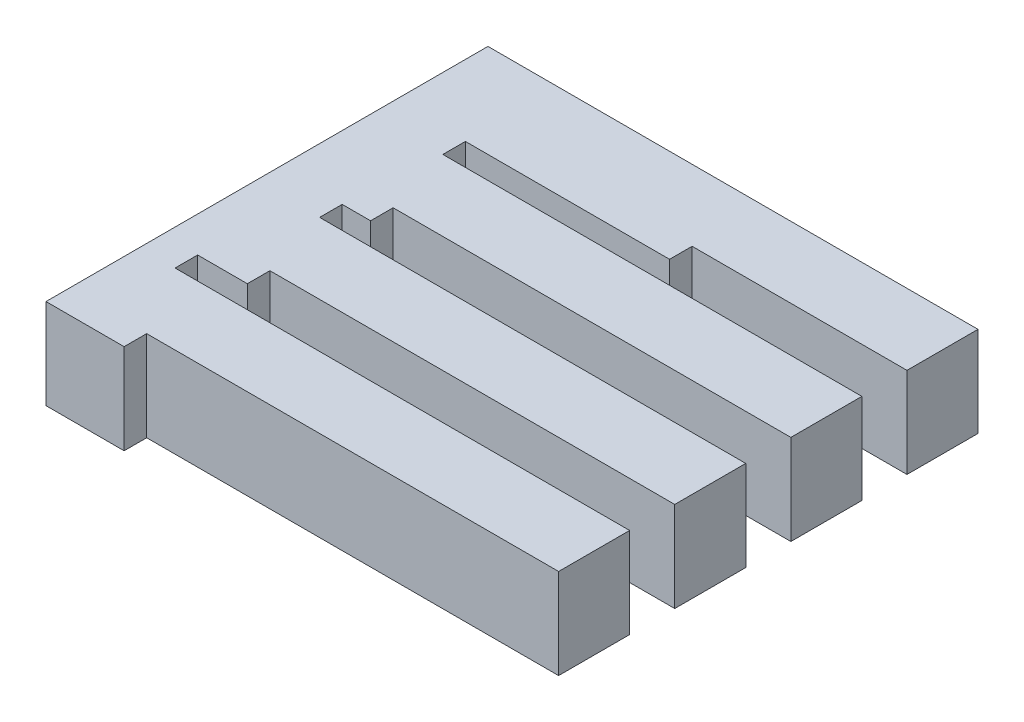
ISO-10303-21;
HEADER;
FILE_DESCRIPTION(('STEP AP214'),'2;1');
FILE_NAME('part.step','',(''),(''),'','','');
FILE_SCHEMA(('AUTOMOTIVE_DESIGN { 1 0 10303 214 1 1 1 1 }'));
ENDSEC;
DATA;
#1=APPLICATION_CONTEXT('core data for automotive mechanical design processes');
#2=APPLICATION_PROTOCOL_DEFINITION('international standard','automotive_design',2000,#1);
#3=PRODUCT_CONTEXT('',#1,'mechanical');
#4=PRODUCT('Part','Part','',(#3));
#5=PRODUCT_RELATED_PRODUCT_CATEGORY('part','',(#4));
#6=PRODUCT_DEFINITION_FORMATION('','',#4);
#7=PRODUCT_DEFINITION_CONTEXT('part definition',#1,'design');
#8=PRODUCT_DEFINITION('design','',#6,#7);
#9=PRODUCT_DEFINITION_SHAPE('','',#8);
#10=(LENGTH_UNIT() NAMED_UNIT(*) SI_UNIT(.MILLI.,.METRE.));
#11=(NAMED_UNIT(*) PLANE_ANGLE_UNIT() SI_UNIT($,.RADIAN.));
#12=(NAMED_UNIT(*) SI_UNIT($,.STERADIAN.) SOLID_ANGLE_UNIT());
#13=UNCERTAINTY_MEASURE_WITH_UNIT(LENGTH_MEASURE(1.E-05),#10,'distance_accuracy_value','');
#14=(GEOMETRIC_REPRESENTATION_CONTEXT(3) GLOBAL_UNCERTAINTY_ASSIGNED_CONTEXT((#13)) GLOBAL_UNIT_ASSIGNED_CONTEXT((#10,
#11,#12)) REPRESENTATION_CONTEXT('',''));
#15=CARTESIAN_POINT('',(0.,0.,0.));
#16=DIRECTION('',(0.,0.,1.));
#17=DIRECTION('',(1.,0.,0.));
#18=AXIS2_PLACEMENT_3D('',#15,#16,#17);
#19=CARTESIAN_POINT('',(-34.5,6.35,-31.1125));
#20=DIRECTION('',(1.,0.,0.));
#21=DIRECTION('',(0.,0.,-1.));
#22=AXIS2_PLACEMENT_3D('',#19,#20,#21);
#23=PLANE('',#22);
#24=DIRECTION('',(0.,0.,1.));
#25=VECTOR('',#24,1.);
#26=CARTESIAN_POINT('',(-34.5,-6.35,-31.1125));
#27=LINE('',#26,#25);
#28=CARTESIAN_POINT('',(-34.5,-6.35,-31.1125));
#29=VERTEX_POINT('',#28);
#30=CARTESIAN_POINT('',(-34.5,-6.35,31.1125));
#31=VERTEX_POINT('',#30);
#32=EDGE_CURVE('E224',#29,#31,#27,.T.);
#33=ORIENTED_EDGE('',*,*,#32,.T.);
#34=DIRECTION('',(0.,-1.,0.));
#35=VECTOR('',#34,1.);
#36=CARTESIAN_POINT('',(-34.5,6.35,31.1125));
#37=LINE('',#36,#35);
#38=CARTESIAN_POINT('',(-34.5,6.35,31.1125));
#39=VERTEX_POINT('',#38);
#40=EDGE_CURVE('E11',#39,#31,#37,.T.);
#41=ORIENTED_EDGE('',*,*,#40,.F.);
#42=DIRECTION('',(0.,0.,1.));
#43=VECTOR('',#42,1.);
#44=CARTESIAN_POINT('',(-34.5,6.35,-31.1125));
#45=LINE('',#44,#43);
#46=CARTESIAN_POINT('',(-34.5,6.35,-31.1125));
#47=VERTEX_POINT('',#46);
#48=EDGE_CURVE('E270',#47,#39,#45,.T.);
#49=ORIENTED_EDGE('',*,*,#48,.F.);
#50=DIRECTION('',(0.,-1.,0.));
#51=VECTOR('',#50,1.);
#52=CARTESIAN_POINT('',(-34.5,6.35,-31.1125));
#53=LINE('',#52,#51);
#54=EDGE_CURVE('E220',#47,#29,#53,.T.);
#55=ORIENTED_EDGE('',*,*,#54,.T.);
#56=EDGE_LOOP('',(#33,#41,#49,#55));
#57=FACE_BOUND('',#56,.T.);
#58=ADVANCED_FACE('F32',(#57),#23,.F.);
#59=CARTESIAN_POINT('',(-34.5,6.35,31.1125));
#60=DIRECTION('',(0.,0.,-1.));
#61=DIRECTION('',(-1.,0.,0.));
#62=AXIS2_PLACEMENT_3D('',#59,#60,#61);
#63=PLANE('',#62);
#64=DIRECTION('',(1.,0.,0.));
#65=VECTOR('',#64,1.);
#66=CARTESIAN_POINT('',(-34.5,-6.35,31.1125));
#67=LINE('',#66,#65);
#68=CARTESIAN_POINT('',(-23.5,-6.35,31.1125));
#69=VERTEX_POINT('',#68);
#70=EDGE_CURVE('E227',#31,#69,#67,.T.);
#71=ORIENTED_EDGE('',*,*,#70,.T.);
#72=DIRECTION('',(0.,-1.,0.));
#73=VECTOR('',#72,1.);
#74=CARTESIAN_POINT('',(-23.5,6.35,31.1125));
#75=LINE('',#74,#73);
#76=CARTESIAN_POINT('',(-23.5,6.35,31.1125));
#77=VERTEX_POINT('',#76);
#78=EDGE_CURVE('E40',#77,#69,#75,.T.);
#79=ORIENTED_EDGE('',*,*,#78,.F.);
#80=DIRECTION('',(1.,0.,0.));
#81=VECTOR('',#80,1.);
#82=CARTESIAN_POINT('',(-34.5,6.35,31.1125));
#83=LINE('',#82,#81);
#84=EDGE_CURVE('E139',#39,#77,#83,.T.);
#85=ORIENTED_EDGE('',*,*,#84,.F.);
#86=ORIENTED_EDGE('',*,*,#40,.T.);
#87=EDGE_LOOP('',(#71,#79,#85,#86));
#88=FACE_BOUND('',#87,.T.);
#89=ADVANCED_FACE('F408',(#88),#63,.F.);
#90=CARTESIAN_POINT('',(-23.5,6.35,31.1125));
#91=DIRECTION('',(-1.,0.,0.));
#92=DIRECTION('',(0.,0.,1.));
#93=AXIS2_PLACEMENT_3D('',#90,#91,#92);
#94=PLANE('',#93);
#95=DIRECTION('',(0.,0.,-1.));
#96=VECTOR('',#95,1.);
#97=CARTESIAN_POINT('',(-23.5,-6.35,31.1125));
#98=LINE('',#97,#96);
#99=CARTESIAN_POINT('',(-23.5,-6.35,27.9375));
#100=VERTEX_POINT('',#99);
#101=EDGE_CURVE('E229',#69,#100,#98,.T.);
#102=ORIENTED_EDGE('',*,*,#101,.T.);
#103=DIRECTION('',(0.,-1.,0.));
#104=VECTOR('',#103,1.);
#105=CARTESIAN_POINT('',(-23.5,6.35,27.9375));
#106=LINE('',#105,#104);
#107=CARTESIAN_POINT('',(-23.5,6.35,27.9375));
#108=VERTEX_POINT('',#107);
#109=EDGE_CURVE('E325',#108,#100,#106,.T.);
#110=ORIENTED_EDGE('',*,*,#109,.F.);
#111=DIRECTION('',(0.,0.,-1.));
#112=VECTOR('',#111,1.);
#113=CARTESIAN_POINT('',(-23.5,6.35,31.1125));
#114=LINE('',#113,#112);
#115=EDGE_CURVE('E333',#77,#108,#114,.T.);
#116=ORIENTED_EDGE('',*,*,#115,.F.);
#117=ORIENTED_EDGE('',*,*,#78,.T.);
#118=EDGE_LOOP('',(#102,#110,#116,#117));
#119=FACE_BOUND('',#118,.T.);
#120=ADVANCED_FACE('F331',(#119),#94,.F.);
#121=CARTESIAN_POINT('',(-23.5,6.35,27.9375));
#122=DIRECTION('',(0.,0.,-1.));
#123=DIRECTION('',(-1.,0.,0.));
#124=AXIS2_PLACEMENT_3D('',#121,#122,#123);
#125=PLANE('',#124);
#126=DIRECTION('',(1.,0.,0.));
#127=VECTOR('',#126,1.);
#128=CARTESIAN_POINT('',(-23.5,-6.35,27.9375));
#129=LINE('',#128,#127);
#130=CARTESIAN_POINT('',(34.5,-6.35,27.9375));
#131=VERTEX_POINT('',#130);
#132=EDGE_CURVE('E231',#100,#131,#129,.T.);
#133=ORIENTED_EDGE('',*,*,#132,.T.);
#134=DIRECTION('',(0.,-1.,0.));
#135=VECTOR('',#134,1.);
#136=CARTESIAN_POINT('',(34.5,6.35,27.9375));
#137=LINE('',#136,#135);
#138=CARTESIAN_POINT('',(34.5,6.35,27.9375));
#139=VERTEX_POINT('',#138);
#140=EDGE_CURVE('E322',#139,#131,#137,.T.);
#141=ORIENTED_EDGE('',*,*,#140,.F.);
#142=DIRECTION('',(1.,0.,0.));
#143=VECTOR('',#142,1.);
#144=CARTESIAN_POINT('',(-23.5,6.35,27.9375));
#145=LINE('',#144,#143);
#146=EDGE_CURVE('E351',#108,#139,#145,.T.);
#147=ORIENTED_EDGE('',*,*,#146,.F.);
#148=ORIENTED_EDGE('',*,*,#109,.T.);
#149=EDGE_LOOP('',(#133,#141,#147,#148));
#150=FACE_BOUND('',#149,.T.);
#151=ADVANCED_FACE('F342',(#150),#125,.F.);
#152=CARTESIAN_POINT('',(34.5,6.35,27.9375));
#153=DIRECTION('',(-1.,0.,0.));
#154=DIRECTION('',(0.,0.,1.));
#155=AXIS2_PLACEMENT_3D('',#152,#153,#154);
#156=PLANE('',#155);
#157=DIRECTION('',(0.,0.,-1.));
#158=VECTOR('',#157,1.);
#159=CARTESIAN_POINT('',(34.5,-6.35,27.9375));
#160=LINE('',#159,#158);
#161=CARTESIAN_POINT('',(34.5,-6.35,17.9375));
#162=VERTEX_POINT('',#161);
#163=EDGE_CURVE('E233',#131,#162,#160,.T.);
#164=ORIENTED_EDGE('',*,*,#163,.T.);
#165=DIRECTION('',(0.,-1.,0.));
#166=VECTOR('',#165,1.);
#167=CARTESIAN_POINT('',(34.5,6.35,17.9375));
#168=LINE('',#167,#166);
#169=CARTESIAN_POINT('',(34.5,6.35,17.9375));
#170=VERTEX_POINT('',#169);
#171=EDGE_CURVE('E319',#170,#162,#168,.T.);
#172=ORIENTED_EDGE('',*,*,#171,.F.);
#173=DIRECTION('',(0.,0.,-1.));
#174=VECTOR('',#173,1.);
#175=CARTESIAN_POINT('',(34.5,6.35,27.9375));
#176=LINE('',#175,#174);
#177=EDGE_CURVE('E348',#139,#170,#176,.T.);
#178=ORIENTED_EDGE('',*,*,#177,.F.);
#179=ORIENTED_EDGE('',*,*,#140,.T.);
#180=EDGE_LOOP('',(#164,#172,#178,#179));
#181=FACE_BOUND('',#180,.T.);
#182=ADVANCED_FACE('F346',(#181),#156,.F.);
#183=CARTESIAN_POINT('',(34.5,6.35,17.9375));
#184=DIRECTION('',(0.,0.,1.));
#185=DIRECTION('',(1.,0.,0.));
#186=AXIS2_PLACEMENT_3D('',#183,#184,#185);
#187=PLANE('',#186);
#188=DIRECTION('',(-1.,0.,0.));
#189=VECTOR('',#188,1.);
#190=CARTESIAN_POINT('',(34.5,-6.35,17.9375));
#191=LINE('',#190,#189);
#192=CARTESIAN_POINT('',(-29.5,-6.35,17.9375));
#193=VERTEX_POINT('',#192);
#194=EDGE_CURVE('E235',#162,#193,#191,.T.);
#195=ORIENTED_EDGE('',*,*,#194,.T.);
#196=DIRECTION('',(0.,-1.,0.));
#197=VECTOR('',#196,1.);
#198=CARTESIAN_POINT('',(-29.5,6.35,17.9375));
#199=LINE('',#198,#197);
#200=CARTESIAN_POINT('',(-29.5,6.35,17.9375));
#201=VERTEX_POINT('',#200);
#202=EDGE_CURVE('E316',#201,#193,#199,.T.);
#203=ORIENTED_EDGE('',*,*,#202,.F.);
#204=DIRECTION('',(-1.,0.,0.));
#205=VECTOR('',#204,1.);
#206=CARTESIAN_POINT('',(34.5,6.35,17.9375));
#207=LINE('',#206,#205);
#208=EDGE_CURVE('E350',#170,#201,#207,.T.);
#209=ORIENTED_EDGE('',*,*,#208,.F.);
#210=ORIENTED_EDGE('',*,*,#171,.T.);
#211=EDGE_LOOP('',(#195,#203,#209,#210));
#212=FACE_BOUND('',#211,.T.);
#213=ADVANCED_FACE('F421',(#212),#187,.F.);
#214=CARTESIAN_POINT('',(-29.5,6.35,17.9375));
#215=DIRECTION('',(-1.,0.,0.));
#216=DIRECTION('',(0.,0.,1.));
#217=AXIS2_PLACEMENT_3D('',#214,#215,#216);
#218=PLANE('',#217);
#219=DIRECTION('',(0.,0.,-1.));
#220=VECTOR('',#219,1.);
#221=CARTESIAN_POINT('',(-29.5,-6.35,17.9375));
#222=LINE('',#221,#220);
#223=CARTESIAN_POINT('',(-29.5,-6.35,14.7625));
#224=VERTEX_POINT('',#223);
#225=EDGE_CURVE('E237',#193,#224,#222,.T.);
#226=ORIENTED_EDGE('',*,*,#225,.T.);
#227=DIRECTION('',(0.,-1.,0.));
#228=VECTOR('',#227,1.);
#229=CARTESIAN_POINT('',(-29.5,6.35,14.7625));
#230=LINE('',#229,#228);
#231=CARTESIAN_POINT('',(-29.5,6.35,14.7625));
#232=VERTEX_POINT('',#231);
#233=EDGE_CURVE('E313',#232,#224,#230,.T.);
#234=ORIENTED_EDGE('',*,*,#233,.F.);
#235=DIRECTION('',(0.,0.,-1.));
#236=VECTOR('',#235,1.);
#237=CARTESIAN_POINT('',(-29.5,6.35,17.9375));
#238=LINE('',#237,#236);
#239=EDGE_CURVE('E353',#201,#232,#238,.T.);
#240=ORIENTED_EDGE('',*,*,#239,.F.);
#241=ORIENTED_EDGE('',*,*,#202,.T.);
#242=EDGE_LOOP('',(#226,#234,#240,#241));
#243=FACE_BOUND('',#242,.T.);
#244=ADVANCED_FACE('F424',(#243),#218,.F.);
#245=CARTESIAN_POINT('',(-29.5,6.35,14.7625));
#246=DIRECTION('',(0.,0.,-1.));
#247=DIRECTION('',(-1.,0.,0.));
#248=AXIS2_PLACEMENT_3D('',#245,#246,#247);
#249=PLANE('',#248);
#250=DIRECTION('',(1.,0.,0.));
#251=VECTOR('',#250,1.);
#252=CARTESIAN_POINT('',(-29.5,-6.35,14.7625));
#253=LINE('',#252,#251);
#254=CARTESIAN_POINT('',(-22.5,-6.35,14.7625));
#255=VERTEX_POINT('',#254);
#256=EDGE_CURVE('E239',#224,#255,#253,.T.);
#257=ORIENTED_EDGE('',*,*,#256,.T.);
#258=DIRECTION('',(0.,-1.,0.));
#259=VECTOR('',#258,1.);
#260=CARTESIAN_POINT('',(-22.5,6.35,14.7625));
#261=LINE('',#260,#259);
#262=CARTESIAN_POINT('',(-22.5,6.35,14.7625));
#263=VERTEX_POINT('',#262);
#264=EDGE_CURVE('E310',#263,#255,#261,.T.);
#265=ORIENTED_EDGE('',*,*,#264,.F.);
#266=DIRECTION('',(1.,0.,0.));
#267=VECTOR('',#266,1.);
#268=CARTESIAN_POINT('',(-29.5,6.35,14.7625));
#269=LINE('',#268,#267);
#270=EDGE_CURVE('E359',#232,#263,#269,.T.);
#271=ORIENTED_EDGE('',*,*,#270,.F.);
#272=ORIENTED_EDGE('',*,*,#233,.T.);
#273=EDGE_LOOP('',(#257,#265,#271,#272));
#274=FACE_BOUND('',#273,.T.);
#275=ADVANCED_FACE('F428',(#274),#249,.F.);
#276=CARTESIAN_POINT('',(-22.5,6.35,14.7625));
#277=DIRECTION('',(-1.,0.,0.));
#278=DIRECTION('',(0.,0.,1.));
#279=AXIS2_PLACEMENT_3D('',#276,#277,#278);
#280=PLANE('',#279);
#281=DIRECTION('',(0.,0.,-1.));
#282=VECTOR('',#281,1.);
#283=CARTESIAN_POINT('',(-22.5,-6.35,14.7625));
#284=LINE('',#283,#282);
#285=CARTESIAN_POINT('',(-22.5,-6.35,11.5875));
#286=VERTEX_POINT('',#285);
#287=EDGE_CURVE('E241',#255,#286,#284,.T.);
#288=ORIENTED_EDGE('',*,*,#287,.T.);
#289=DIRECTION('',(0.,-1.,0.));
#290=VECTOR('',#289,1.);
#291=CARTESIAN_POINT('',(-22.5,6.35,11.5875));
#292=LINE('',#291,#290);
#293=CARTESIAN_POINT('',(-22.5,6.35,11.5875));
#294=VERTEX_POINT('',#293);
#295=EDGE_CURVE('E307',#294,#286,#292,.T.);
#296=ORIENTED_EDGE('',*,*,#295,.F.);
#297=DIRECTION('',(0.,0.,-1.));
#298=VECTOR('',#297,1.);
#299=CARTESIAN_POINT('',(-22.5,6.35,14.7625));
#300=LINE('',#299,#298);
#301=EDGE_CURVE('E361',#263,#294,#300,.T.);
#302=ORIENTED_EDGE('',*,*,#301,.F.);
#303=ORIENTED_EDGE('',*,*,#264,.T.);
#304=EDGE_LOOP('',(#288,#296,#302,#303));
#305=FACE_BOUND('',#304,.T.);
#306=ADVANCED_FACE('F432',(#305),#280,.F.);
#307=CARTESIAN_POINT('',(-22.5,6.35,11.5875));
#308=DIRECTION('',(0.,0.,-1.));
#309=DIRECTION('',(-1.,0.,0.));
#310=AXIS2_PLACEMENT_3D('',#307,#308,#309);
#311=PLANE('',#310);
#312=DIRECTION('',(1.,0.,0.));
#313=VECTOR('',#312,1.);
#314=CARTESIAN_POINT('',(-22.5,-6.35,11.5875));
#315=LINE('',#314,#313);
#316=CARTESIAN_POINT('',(34.5,-6.35,11.5875));
#317=VERTEX_POINT('',#316);
#318=EDGE_CURVE('E243',#286,#317,#315,.T.);
#319=ORIENTED_EDGE('',*,*,#318,.T.);
#320=DIRECTION('',(0.,-1.,0.));
#321=VECTOR('',#320,1.);
#322=CARTESIAN_POINT('',(34.5,6.35,11.5875));
#323=LINE('',#322,#321);
#324=CARTESIAN_POINT('',(34.5,6.35,11.5875));
#325=VERTEX_POINT('',#324);
#326=EDGE_CURVE('E304',#325,#317,#323,.T.);
#327=ORIENTED_EDGE('',*,*,#326,.F.);
#328=DIRECTION('',(1.,0.,0.));
#329=VECTOR('',#328,1.);
#330=CARTESIAN_POINT('',(-22.5,6.35,11.5875));
#331=LINE('',#330,#329);
#332=EDGE_CURVE('E363',#294,#325,#331,.T.);
#333=ORIENTED_EDGE('',*,*,#332,.F.);
#334=ORIENTED_EDGE('',*,*,#295,.T.);
#335=EDGE_LOOP('',(#319,#327,#333,#334));
#336=FACE_BOUND('',#335,.T.);
#337=ADVANCED_FACE('F436',(#336),#311,.F.);
#338=CARTESIAN_POINT('',(34.5,6.35,11.5875));
#339=DIRECTION('',(-1.,0.,0.));
#340=DIRECTION('',(0.,0.,1.));
#341=AXIS2_PLACEMENT_3D('',#338,#339,#340);
#342=PLANE('',#341);
#343=DIRECTION('',(0.,0.,-1.));
#344=VECTOR('',#343,1.);
#345=CARTESIAN_POINT('',(34.5,-6.35,11.5875));
#346=LINE('',#345,#344);
#347=CARTESIAN_POINT('',(34.5,-6.35,1.58749999999999));
#348=VERTEX_POINT('',#347);
#349=EDGE_CURVE('E245',#317,#348,#346,.T.);
#350=ORIENTED_EDGE('',*,*,#349,.T.);
#351=DIRECTION('',(0.,-1.,0.));
#352=VECTOR('',#351,1.);
#353=CARTESIAN_POINT('',(34.5,6.35,1.58749999999999));
#354=LINE('',#353,#352);
#355=CARTESIAN_POINT('',(34.5,6.35,1.58749999999999));
#356=VERTEX_POINT('',#355);
#357=EDGE_CURVE('E301',#356,#348,#354,.T.);
#358=ORIENTED_EDGE('',*,*,#357,.F.);
#359=DIRECTION('',(0.,0.,-1.));
#360=VECTOR('',#359,1.);
#361=CARTESIAN_POINT('',(34.5,6.35,11.5875));
#362=LINE('',#361,#360);
#363=EDGE_CURVE('E365',#325,#356,#362,.T.);
#364=ORIENTED_EDGE('',*,*,#363,.F.);
#365=ORIENTED_EDGE('',*,*,#326,.T.);
#366=EDGE_LOOP('',(#350,#358,#364,#365));
#367=FACE_BOUND('',#366,.T.);
#368=ADVANCED_FACE('F440',(#367),#342,.F.);
#369=CARTESIAN_POINT('',(34.5,6.35,1.58749999999999));
#370=DIRECTION('',(0.,0.,1.));
#371=DIRECTION('',(1.,0.,0.));
#372=AXIS2_PLACEMENT_3D('',#369,#370,#371);
#373=PLANE('',#372);
#374=DIRECTION('',(-1.,0.,0.));
#375=VECTOR('',#374,1.);
#376=CARTESIAN_POINT('',(34.5,-6.35,1.58749999999999));
#377=LINE('',#376,#375);
#378=CARTESIAN_POINT('',(-25.5,-6.35,1.5875));
#379=VERTEX_POINT('',#378);
#380=EDGE_CURVE('E247',#348,#379,#377,.T.);
#381=ORIENTED_EDGE('',*,*,#380,.T.);
#382=DIRECTION('',(0.,-1.,0.));
#383=VECTOR('',#382,1.);
#384=CARTESIAN_POINT('',(-25.5,6.35,1.5875));
#385=LINE('',#384,#383);
#386=CARTESIAN_POINT('',(-25.5,6.35,1.5875));
#387=VERTEX_POINT('',#386);
#388=EDGE_CURVE('E298',#387,#379,#385,.T.);
#389=ORIENTED_EDGE('',*,*,#388,.F.);
#390=DIRECTION('',(-1.,0.,0.));
#391=VECTOR('',#390,1.);
#392=CARTESIAN_POINT('',(34.5,6.35,1.58749999999999));
#393=LINE('',#392,#391);
#394=EDGE_CURVE('E367',#356,#387,#393,.T.);
#395=ORIENTED_EDGE('',*,*,#394,.F.);
#396=ORIENTED_EDGE('',*,*,#357,.T.);
#397=EDGE_LOOP('',(#381,#389,#395,#396));
#398=FACE_BOUND('',#397,.T.);
#399=ADVANCED_FACE('F444',(#398),#373,.F.);
#400=CARTESIAN_POINT('',(-25.5,6.35,1.5875));
#401=DIRECTION('',(-1.,0.,0.));
#402=DIRECTION('',(0.,0.,1.));
#403=AXIS2_PLACEMENT_3D('',#400,#401,#402);
#404=PLANE('',#403);
#405=DIRECTION('',(0.,0.,-1.));
#406=VECTOR('',#405,1.);
#407=CARTESIAN_POINT('',(-25.5,-6.35,1.5875));
#408=LINE('',#407,#406);
#409=CARTESIAN_POINT('',(-25.5,-6.35,-1.5875));
#410=VERTEX_POINT('',#409);
#411=EDGE_CURVE('E249',#379,#410,#408,.T.);
#412=ORIENTED_EDGE('',*,*,#411,.T.);
#413=DIRECTION('',(0.,-1.,0.));
#414=VECTOR('',#413,1.);
#415=CARTESIAN_POINT('',(-25.5,6.35,-1.5875));
#416=LINE('',#415,#414);
#417=CARTESIAN_POINT('',(-25.5,6.35,-1.5875));
#418=VERTEX_POINT('',#417);
#419=EDGE_CURVE('E295',#418,#410,#416,.T.);
#420=ORIENTED_EDGE('',*,*,#419,.F.);
#421=DIRECTION('',(0.,0.,-1.));
#422=VECTOR('',#421,1.);
#423=CARTESIAN_POINT('',(-25.5,6.35,1.5875));
#424=LINE('',#423,#422);
#425=EDGE_CURVE('E369',#387,#418,#424,.T.);
#426=ORIENTED_EDGE('',*,*,#425,.F.);
#427=ORIENTED_EDGE('',*,*,#388,.T.);
#428=EDGE_LOOP('',(#412,#420,#426,#427));
#429=FACE_BOUND('',#428,.T.);
#430=ADVANCED_FACE('F448',(#429),#404,.F.);
#431=CARTESIAN_POINT('',(-25.5,6.35,-1.5875));
#432=DIRECTION('',(0.,0.,-1.));
#433=DIRECTION('',(-1.,0.,0.));
#434=AXIS2_PLACEMENT_3D('',#431,#432,#433);
#435=PLANE('',#434);
#436=DIRECTION('',(1.,0.,0.));
#437=VECTOR('',#436,1.);
#438=CARTESIAN_POINT('',(-25.5,-6.35,-1.5875));
#439=LINE('',#438,#437);
#440=CARTESIAN_POINT('',(-21.5,-6.35,-1.5875));
#441=VERTEX_POINT('',#440);
#442=EDGE_CURVE('E251',#410,#441,#439,.T.);
#443=ORIENTED_EDGE('',*,*,#442,.T.);
#444=DIRECTION('',(0.,-1.,0.));
#445=VECTOR('',#444,1.);
#446=CARTESIAN_POINT('',(-21.5,6.35,-1.5875));
#447=LINE('',#446,#445);
#448=CARTESIAN_POINT('',(-21.5,6.35,-1.5875));
#449=VERTEX_POINT('',#448);
#450=EDGE_CURVE('E292',#449,#441,#447,.T.);
#451=ORIENTED_EDGE('',*,*,#450,.F.);
#452=DIRECTION('',(1.,0.,0.));
#453=VECTOR('',#452,1.);
#454=CARTESIAN_POINT('',(-25.5,6.35,-1.5875));
#455=LINE('',#454,#453);
#456=EDGE_CURVE('E371',#418,#449,#455,.T.);
#457=ORIENTED_EDGE('',*,*,#456,.F.);
#458=ORIENTED_EDGE('',*,*,#419,.T.);
#459=EDGE_LOOP('',(#443,#451,#457,#458));
#460=FACE_BOUND('',#459,.T.);
#461=ADVANCED_FACE('F452',(#460),#435,.F.);
#462=CARTESIAN_POINT('',(-21.5,6.35,-1.5875));
#463=DIRECTION('',(-1.,0.,0.));
#464=DIRECTION('',(0.,0.,1.));
#465=AXIS2_PLACEMENT_3D('',#462,#463,#464);
#466=PLANE('',#465);
#467=DIRECTION('',(0.,0.,-1.));
#468=VECTOR('',#467,1.);
#469=CARTESIAN_POINT('',(-21.5,-6.35,-1.5875));
#470=LINE('',#469,#468);
#471=CARTESIAN_POINT('',(-21.5,-6.35,-4.76249999999999));
#472=VERTEX_POINT('',#471);
#473=EDGE_CURVE('E253',#441,#472,#470,.T.);
#474=ORIENTED_EDGE('',*,*,#473,.T.);
#475=DIRECTION('',(0.,-1.,0.));
#476=VECTOR('',#475,1.);
#477=CARTESIAN_POINT('',(-21.5,6.35,-4.76249999999999));
#478=LINE('',#477,#476);
#479=CARTESIAN_POINT('',(-21.5,6.35,-4.76249999999999));
#480=VERTEX_POINT('',#479);
#481=EDGE_CURVE('E289',#480,#472,#478,.T.);
#482=ORIENTED_EDGE('',*,*,#481,.F.);
#483=DIRECTION('',(0.,0.,-1.));
#484=VECTOR('',#483,1.);
#485=CARTESIAN_POINT('',(-21.5,6.35,-1.5875));
#486=LINE('',#485,#484);
#487=EDGE_CURVE('E373',#449,#480,#486,.T.);
#488=ORIENTED_EDGE('',*,*,#487,.F.);
#489=ORIENTED_EDGE('',*,*,#450,.T.);
#490=EDGE_LOOP('',(#474,#482,#488,#489));
#491=FACE_BOUND('',#490,.T.);
#492=ADVANCED_FACE('F456',(#491),#466,.F.);
#493=CARTESIAN_POINT('',(-21.5,6.35,-4.76249999999999));
#494=DIRECTION('',(0.,0.,-1.));
#495=DIRECTION('',(-1.,0.,0.));
#496=AXIS2_PLACEMENT_3D('',#493,#494,#495);
#497=PLANE('',#496);
#498=DIRECTION('',(1.,0.,0.));
#499=VECTOR('',#498,1.);
#500=CARTESIAN_POINT('',(-21.5,-6.35,-4.76249999999999));
#501=LINE('',#500,#499);
#502=CARTESIAN_POINT('',(34.5,-6.35,-4.7625));
#503=VERTEX_POINT('',#502);
#504=EDGE_CURVE('E255',#472,#503,#501,.T.);
#505=ORIENTED_EDGE('',*,*,#504,.T.);
#506=DIRECTION('',(0.,-1.,0.));
#507=VECTOR('',#506,1.);
#508=CARTESIAN_POINT('',(34.5,6.35,-4.7625));
#509=LINE('',#508,#507);
#510=CARTESIAN_POINT('',(34.5,6.35,-4.7625));
#511=VERTEX_POINT('',#510);
#512=EDGE_CURVE('E286',#511,#503,#509,.T.);
#513=ORIENTED_EDGE('',*,*,#512,.F.);
#514=DIRECTION('',(1.,0.,0.));
#515=VECTOR('',#514,1.);
#516=CARTESIAN_POINT('',(-21.5,6.35,-4.76249999999999));
#517=LINE('',#516,#515);
#518=EDGE_CURVE('E375',#480,#511,#517,.T.);
#519=ORIENTED_EDGE('',*,*,#518,.F.);
#520=ORIENTED_EDGE('',*,*,#481,.T.);
#521=EDGE_LOOP('',(#505,#513,#519,#520));
#522=FACE_BOUND('',#521,.T.);
#523=ADVANCED_FACE('F460',(#522),#497,.F.);
#524=CARTESIAN_POINT('',(34.5,6.35,-4.7625));
#525=DIRECTION('',(-1.,0.,0.));
#526=DIRECTION('',(0.,0.,1.));
#527=AXIS2_PLACEMENT_3D('',#524,#525,#526);
#528=PLANE('',#527);
#529=DIRECTION('',(0.,0.,-1.));
#530=VECTOR('',#529,1.);
#531=CARTESIAN_POINT('',(34.5,-6.35,-4.7625));
#532=LINE('',#531,#530);
#533=CARTESIAN_POINT('',(34.5,-6.35,-14.7625));
#534=VERTEX_POINT('',#533);
#535=EDGE_CURVE('E257',#503,#534,#532,.T.);
#536=ORIENTED_EDGE('',*,*,#535,.T.);
#537=DIRECTION('',(0.,-1.,0.));
#538=VECTOR('',#537,1.);
#539=CARTESIAN_POINT('',(34.5,6.35,-14.7625));
#540=LINE('',#539,#538);
#541=CARTESIAN_POINT('',(34.5,6.35,-14.7625));
#542=VERTEX_POINT('',#541);
#543=EDGE_CURVE('E283',#542,#534,#540,.T.);
#544=ORIENTED_EDGE('',*,*,#543,.F.);
#545=DIRECTION('',(0.,0.,-1.));
#546=VECTOR('',#545,1.);
#547=CARTESIAN_POINT('',(34.5,6.35,-4.7625));
#548=LINE('',#547,#546);
#549=EDGE_CURVE('E377',#511,#542,#548,.T.);
#550=ORIENTED_EDGE('',*,*,#549,.F.);
#551=ORIENTED_EDGE('',*,*,#512,.T.);
#552=EDGE_LOOP('',(#536,#544,#550,#551));
#553=FACE_BOUND('',#552,.T.);
#554=ADVANCED_FACE('F464',(#553),#528,.F.);
#555=CARTESIAN_POINT('',(34.5,6.35,-14.7625));
#556=DIRECTION('',(0.,0.,1.));
#557=DIRECTION('',(1.,0.,0.));
#558=AXIS2_PLACEMENT_3D('',#555,#556,#557);
#559=PLANE('',#558);
#560=DIRECTION('',(-1.,0.,0.));
#561=VECTOR('',#560,1.);
#562=CARTESIAN_POINT('',(34.5,-6.35,-14.7625));
#563=LINE('',#562,#561);
#564=CARTESIAN_POINT('',(-24.5,-6.35,-14.7625));
#565=VERTEX_POINT('',#564);
#566=EDGE_CURVE('E259',#534,#565,#563,.T.);
#567=ORIENTED_EDGE('',*,*,#566,.T.);
#568=DIRECTION('',(0.,-1.,0.));
#569=VECTOR('',#568,1.);
#570=CARTESIAN_POINT('',(-24.5,6.35,-14.7625));
#571=LINE('',#570,#569);
#572=CARTESIAN_POINT('',(-24.5,6.35,-14.7625));
#573=VERTEX_POINT('',#572);
#574=EDGE_CURVE('E280',#573,#565,#571,.T.);
#575=ORIENTED_EDGE('',*,*,#574,.F.);
#576=DIRECTION('',(-1.,0.,0.));
#577=VECTOR('',#576,1.);
#578=CARTESIAN_POINT('',(34.5,6.35,-14.7625));
#579=LINE('',#578,#577);
#580=EDGE_CURVE('E379',#542,#573,#579,.T.);
#581=ORIENTED_EDGE('',*,*,#580,.F.);
#582=ORIENTED_EDGE('',*,*,#543,.T.);
#583=EDGE_LOOP('',(#567,#575,#581,#582));
#584=FACE_BOUND('',#583,.T.);
#585=ADVANCED_FACE('F468',(#584),#559,.F.);
#586=CARTESIAN_POINT('',(-24.5,6.35,-14.7625));
#587=DIRECTION('',(-1.,0.,0.));
#588=DIRECTION('',(0.,0.,1.));
#589=AXIS2_PLACEMENT_3D('',#586,#587,#588);
#590=PLANE('',#589);
#591=DIRECTION('',(0.,0.,-1.));
#592=VECTOR('',#591,1.);
#593=CARTESIAN_POINT('',(-24.5,-6.35,-14.7625));
#594=LINE('',#593,#592);
#595=CARTESIAN_POINT('',(-24.5,-6.35,-17.9375));
#596=VERTEX_POINT('',#595);
#597=EDGE_CURVE('E261',#565,#596,#594,.T.);
#598=ORIENTED_EDGE('',*,*,#597,.T.);
#599=DIRECTION('',(0.,-1.,0.));
#600=VECTOR('',#599,1.);
#601=CARTESIAN_POINT('',(-24.5,6.35,-17.9375));
#602=LINE('',#601,#600);
#603=CARTESIAN_POINT('',(-24.5,6.35,-17.9375));
#604=VERTEX_POINT('',#603);
#605=EDGE_CURVE('E277',#604,#596,#602,.T.);
#606=ORIENTED_EDGE('',*,*,#605,.F.);
#607=DIRECTION('',(0.,0.,-1.));
#608=VECTOR('',#607,1.);
#609=CARTESIAN_POINT('',(-24.5,6.35,-14.7625));
#610=LINE('',#609,#608);
#611=EDGE_CURVE('E381',#573,#604,#610,.T.);
#612=ORIENTED_EDGE('',*,*,#611,.F.);
#613=ORIENTED_EDGE('',*,*,#574,.T.);
#614=EDGE_LOOP('',(#598,#606,#612,#613));
#615=FACE_BOUND('',#614,.T.);
#616=ADVANCED_FACE('F472',(#615),#590,.F.);
#617=CARTESIAN_POINT('',(-24.5,6.35,-17.9375));
#618=DIRECTION('',(0.,0.,-1.));
#619=DIRECTION('',(-1.,0.,0.));
#620=AXIS2_PLACEMENT_3D('',#617,#618,#619);
#621=PLANE('',#620);
#622=DIRECTION('',(1.,0.,0.));
#623=VECTOR('',#622,1.);
#624=CARTESIAN_POINT('',(-24.5,-6.35,-17.9375));
#625=LINE('',#624,#623);
#626=CARTESIAN_POINT('',(4.24574702,-6.35,-17.9375));
#627=VERTEX_POINT('',#626);
#628=EDGE_CURVE('E263',#596,#627,#625,.T.);
#629=ORIENTED_EDGE('',*,*,#628,.T.);
#630=DIRECTION('',(0.,-1.,0.));
#631=VECTOR('',#630,1.);
#632=CARTESIAN_POINT('',(4.24574702,6.35,-17.9375));
#633=LINE('',#632,#631);
#634=CARTESIAN_POINT('',(4.24574702,6.35,-17.9375));
#635=VERTEX_POINT('',#634);
#636=EDGE_CURVE('E274',#635,#627,#633,.T.);
#637=ORIENTED_EDGE('',*,*,#636,.F.);
#638=DIRECTION('',(1.,0.,0.));
#639=VECTOR('',#638,1.);
#640=CARTESIAN_POINT('',(-24.5,6.35,-17.9375));
#641=LINE('',#640,#639);
#642=EDGE_CURVE('E383',#604,#635,#641,.T.);
#643=ORIENTED_EDGE('',*,*,#642,.F.);
#644=ORIENTED_EDGE('',*,*,#605,.T.);
#645=EDGE_LOOP('',(#629,#637,#643,#644));
#646=FACE_BOUND('',#645,.T.);
#647=ADVANCED_FACE('F389',(#646),#621,.F.);
#648=CARTESIAN_POINT('',(4.24574702,6.35,-17.9375));
#649=DIRECTION('',(-1.,0.,0.));
#650=DIRECTION('',(0.,0.,1.));
#651=AXIS2_PLACEMENT_3D('',#648,#649,#650);
#652=PLANE('',#651);
#653=DIRECTION('',(0.,0.,-1.));
#654=VECTOR('',#653,1.);
#655=CARTESIAN_POINT('',(4.24574702,-6.35,-17.9375));
#656=LINE('',#655,#654);
#657=CARTESIAN_POINT('',(4.24574702,-6.35,-21.1125));
#658=VERTEX_POINT('',#657);
#659=EDGE_CURVE('E265',#627,#658,#656,.T.);
#660=ORIENTED_EDGE('',*,*,#659,.T.);
#661=DIRECTION('',(0.,-1.,0.));
#662=VECTOR('',#661,1.);
#663=CARTESIAN_POINT('',(4.24574702,6.35,-21.1125));
#664=LINE('',#663,#662);
#665=CARTESIAN_POINT('',(4.24574702,6.35,-21.1125));
#666=VERTEX_POINT('',#665);
#667=EDGE_CURVE('E215',#666,#658,#664,.T.);
#668=ORIENTED_EDGE('',*,*,#667,.F.);
#669=DIRECTION('',(0.,0.,-1.));
#670=VECTOR('',#669,1.);
#671=CARTESIAN_POINT('',(4.24574702,6.35,-17.9375));
#672=LINE('',#671,#670);
#673=EDGE_CURVE('E206',#635,#666,#672,.T.);
#674=ORIENTED_EDGE('',*,*,#673,.F.);
#675=ORIENTED_EDGE('',*,*,#636,.T.);
#676=EDGE_LOOP('',(#660,#668,#674,#675));
#677=FACE_BOUND('',#676,.T.);
#678=ADVANCED_FACE('F393',(#677),#652,.F.);
#679=CARTESIAN_POINT('',(4.24574702,6.35,-21.1125));
#680=DIRECTION('',(0.,0.,-1.));
#681=DIRECTION('',(-1.,0.,0.));
#682=AXIS2_PLACEMENT_3D('',#679,#680,#681);
#683=PLANE('',#682);
#684=DIRECTION('',(1.,0.,0.));
#685=VECTOR('',#684,1.);
#686=CARTESIAN_POINT('',(4.24574702,-6.35,-21.1125));
#687=LINE('',#686,#685);
#688=CARTESIAN_POINT('',(34.5,-6.35,-21.1125));
#689=VERTEX_POINT('',#688);
#690=EDGE_CURVE('E214',#658,#689,#687,.T.);
#691=ORIENTED_EDGE('',*,*,#690,.T.);
#692=DIRECTION('',(0.,-1.,0.));
#693=VECTOR('',#692,1.);
#694=CARTESIAN_POINT('',(34.5,6.35,-21.1125));
#695=LINE('',#694,#693);
#696=CARTESIAN_POINT('',(34.5,6.35,-21.1125));
#697=VERTEX_POINT('',#696);
#698=EDGE_CURVE('E211',#697,#689,#695,.T.);
#699=ORIENTED_EDGE('',*,*,#698,.F.);
#700=DIRECTION('',(1.,0.,0.));
#701=VECTOR('',#700,1.);
#702=CARTESIAN_POINT('',(4.24574702,6.35,-21.1125));
#703=LINE('',#702,#701);
#704=EDGE_CURVE('E200',#666,#697,#703,.T.);
#705=ORIENTED_EDGE('',*,*,#704,.F.);
#706=ORIENTED_EDGE('',*,*,#667,.T.);
#707=EDGE_LOOP('',(#691,#699,#705,#706));
#708=FACE_BOUND('',#707,.T.);
#709=ADVANCED_FACE('F212',(#708),#683,.F.);
#710=CARTESIAN_POINT('',(34.5,6.35,-21.1125));
#711=DIRECTION('',(-1.,0.,0.));
#712=DIRECTION('',(0.,0.,1.));
#713=AXIS2_PLACEMENT_3D('',#710,#711,#712);
#714=PLANE('',#713);
#715=DIRECTION('',(0.,0.,-1.));
#716=VECTOR('',#715,1.);
#717=CARTESIAN_POINT('',(34.5,-6.35,-21.1125));
#718=LINE('',#717,#716);
#719=CARTESIAN_POINT('',(34.5,-6.35,-31.1125));
#720=VERTEX_POINT('',#719);
#721=EDGE_CURVE('E125',#689,#720,#718,.T.);
#722=ORIENTED_EDGE('',*,*,#721,.T.);
#723=DIRECTION('',(0.,-1.,0.));
#724=VECTOR('',#723,1.);
#725=CARTESIAN_POINT('',(34.5,6.35,-31.1125));
#726=LINE('',#725,#724);
#727=CARTESIAN_POINT('',(34.5,6.35,-31.1125));
#728=VERTEX_POINT('',#727);
#729=EDGE_CURVE('E216',#728,#720,#726,.T.);
#730=ORIENTED_EDGE('',*,*,#729,.F.);
#731=DIRECTION('',(0.,0.,-1.));
#732=VECTOR('',#731,1.);
#733=CARTESIAN_POINT('',(34.5,6.35,-21.1125));
#734=LINE('',#733,#732);
#735=EDGE_CURVE('E204',#697,#728,#734,.T.);
#736=ORIENTED_EDGE('',*,*,#735,.F.);
#737=ORIENTED_EDGE('',*,*,#698,.T.);
#738=EDGE_LOOP('',(#722,#730,#736,#737));
#739=FACE_BOUND('',#738,.T.);
#740=ADVANCED_FACE('F218',(#739),#714,.F.);
#741=CARTESIAN_POINT('',(34.5,6.35,-31.1125));
#742=DIRECTION('',(0.,0.,1.));
#743=DIRECTION('',(1.,0.,0.));
#744=AXIS2_PLACEMENT_3D('',#741,#742,#743);
#745=PLANE('',#744);
#746=DIRECTION('',(-1.,0.,0.));
#747=VECTOR('',#746,1.);
#748=CARTESIAN_POINT('',(34.5,-6.35,-31.1125));
#749=LINE('',#748,#747);
#750=EDGE_CURVE('E131',#720,#29,#749,.T.);
#751=ORIENTED_EDGE('',*,*,#750,.T.);
#752=ORIENTED_EDGE('',*,*,#54,.F.);
#753=DIRECTION('',(-1.,0.,0.));
#754=VECTOR('',#753,1.);
#755=CARTESIAN_POINT('',(34.5,6.35,-31.1125));
#756=LINE('',#755,#754);
#757=EDGE_CURVE('E48',#728,#47,#756,.T.);
#758=ORIENTED_EDGE('',*,*,#757,.F.);
#759=ORIENTED_EDGE('',*,*,#729,.T.);
#760=EDGE_LOOP('',(#751,#752,#758,#759));
#761=FACE_BOUND('',#760,.T.);
#762=ADVANCED_FACE('F397',(#761),#745,.F.);
#763=CARTESIAN_POINT('',(0.,6.35,0.));
#764=DIRECTION('',(0.,1.,0.));
#765=DIRECTION('',(0.,0.,1.));
#766=AXIS2_PLACEMENT_3D('',#763,#764,#765);
#767=PLANE('',#766);
#768=ORIENTED_EDGE('',*,*,#48,.T.);
#769=ORIENTED_EDGE('',*,*,#84,.T.);
#770=ORIENTED_EDGE('',*,*,#115,.T.);
#771=ORIENTED_EDGE('',*,*,#146,.T.);
#772=ORIENTED_EDGE('',*,*,#177,.T.);
#773=ORIENTED_EDGE('',*,*,#208,.T.);
#774=ORIENTED_EDGE('',*,*,#239,.T.);
#775=ORIENTED_EDGE('',*,*,#270,.T.);
#776=ORIENTED_EDGE('',*,*,#301,.T.);
#777=ORIENTED_EDGE('',*,*,#332,.T.);
#778=ORIENTED_EDGE('',*,*,#363,.T.);
#779=ORIENTED_EDGE('',*,*,#394,.T.);
#780=ORIENTED_EDGE('',*,*,#425,.T.);
#781=ORIENTED_EDGE('',*,*,#456,.T.);
#782=ORIENTED_EDGE('',*,*,#487,.T.);
#783=ORIENTED_EDGE('',*,*,#518,.T.);
#784=ORIENTED_EDGE('',*,*,#549,.T.);
#785=ORIENTED_EDGE('',*,*,#580,.T.);
#786=ORIENTED_EDGE('',*,*,#611,.T.);
#787=ORIENTED_EDGE('',*,*,#642,.T.);
#788=ORIENTED_EDGE('',*,*,#673,.T.);
#789=ORIENTED_EDGE('',*,*,#704,.T.);
#790=ORIENTED_EDGE('',*,*,#735,.T.);
#791=ORIENTED_EDGE('',*,*,#757,.T.);
#792=EDGE_LOOP('',(#768,#769,#770,#771,#772,#773,#774,#775,#776,#777,#778,#779,#780,#781,#782,
#783,#784,#785,#786,#787,#788,#789,#790,#791));
#793=FACE_BOUND('',#792,.T.);
#794=ADVANCED_FACE('F202',(#793),#767,.T.);
#795=CARTESIAN_POINT('',(0.,-6.35,0.));
#796=DIRECTION('',(0.,1.,0.));
#797=DIRECTION('',(0.,0.,1.));
#798=AXIS2_PLACEMENT_3D('',#795,#796,#797);
#799=PLANE('',#798);
#800=ORIENTED_EDGE('',*,*,#32,.F.);
#801=ORIENTED_EDGE('',*,*,#750,.F.);
#802=ORIENTED_EDGE('',*,*,#721,.F.);
#803=ORIENTED_EDGE('',*,*,#690,.F.);
#804=ORIENTED_EDGE('',*,*,#659,.F.);
#805=ORIENTED_EDGE('',*,*,#628,.F.);
#806=ORIENTED_EDGE('',*,*,#597,.F.);
#807=ORIENTED_EDGE('',*,*,#566,.F.);
#808=ORIENTED_EDGE('',*,*,#535,.F.);
#809=ORIENTED_EDGE('',*,*,#504,.F.);
#810=ORIENTED_EDGE('',*,*,#473,.F.);
#811=ORIENTED_EDGE('',*,*,#442,.F.);
#812=ORIENTED_EDGE('',*,*,#411,.F.);
#813=ORIENTED_EDGE('',*,*,#380,.F.);
#814=ORIENTED_EDGE('',*,*,#349,.F.);
#815=ORIENTED_EDGE('',*,*,#318,.F.);
#816=ORIENTED_EDGE('',*,*,#287,.F.);
#817=ORIENTED_EDGE('',*,*,#256,.F.);
#818=ORIENTED_EDGE('',*,*,#225,.F.);
#819=ORIENTED_EDGE('',*,*,#194,.F.);
#820=ORIENTED_EDGE('',*,*,#163,.F.);
#821=ORIENTED_EDGE('',*,*,#132,.F.);
#822=ORIENTED_EDGE('',*,*,#101,.F.);
#823=ORIENTED_EDGE('',*,*,#70,.F.);
#824=EDGE_LOOP('',(#800,#801,#802,#803,#804,#805,#806,#807,#808,#809,#810,#811,#812,#813,#814,
#815,#816,#817,#818,#819,#820,#821,#822,#823));
#825=FACE_BOUND('',#824,.T.);
#826=ADVANCED_FACE('F337',(#825),#799,.F.);
#827=CLOSED_SHELL('',(#58,#89,#120,#151,#182,#213,#244,#275,#306,#337,#368,#399,#430,#461,#492,
#523,#554,#585,#616,#647,#678,#709,#740,#762,#794,#826));
#828=MANIFOLD_SOLID_BREP('B2',#827);
#829=ADVANCED_BREP_SHAPE_REPRESENTATION('',(#18,#828),#14);
#830=SHAPE_DEFINITION_REPRESENTATION(#9,#829);
ENDSEC;
END-ISO-10303-21;
